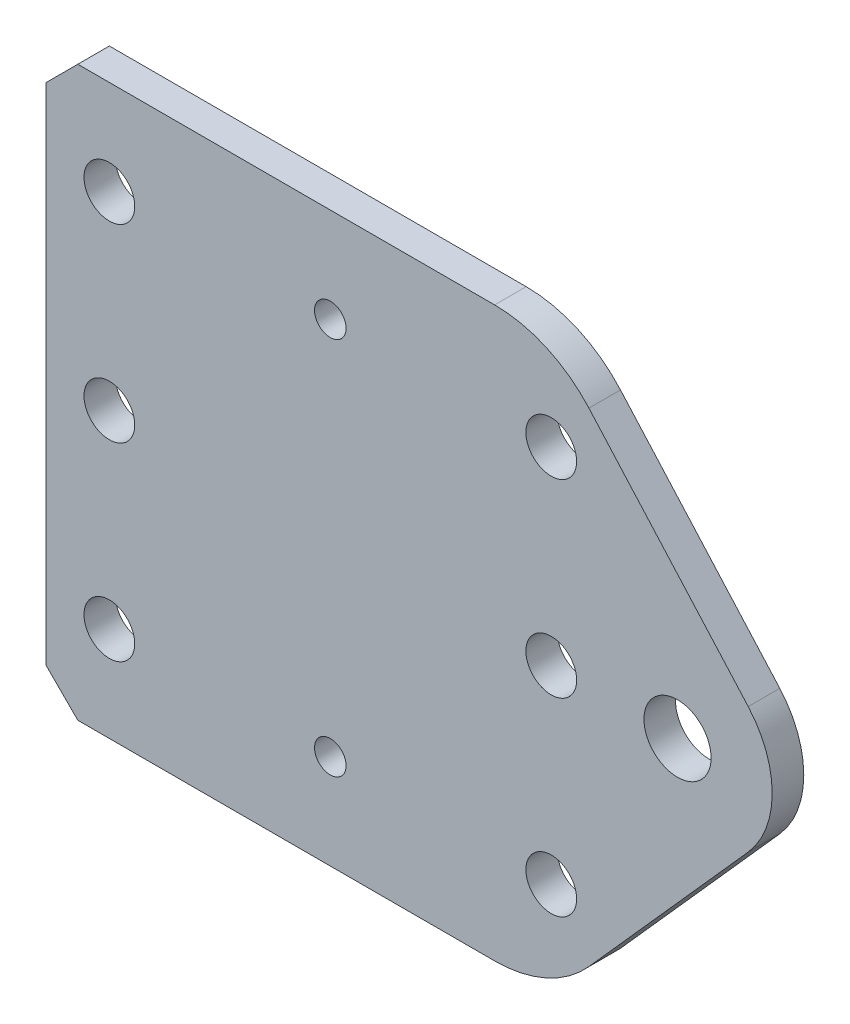
ISO-10303-21;
HEADER;
FILE_DESCRIPTION(('STEP AP214'),'2;1');
FILE_NAME('part.step','',(''),(''),'','','');
FILE_SCHEMA(('AUTOMOTIVE_DESIGN { 1 0 10303 214 1 1 1 1 }'));
ENDSEC;
DATA;
#1=APPLICATION_CONTEXT('core data for automotive mechanical design processes');
#2=APPLICATION_PROTOCOL_DEFINITION('international standard','automotive_design',2000,#1);
#3=PRODUCT_CONTEXT('',#1,'mechanical');
#4=PRODUCT('Part','Part','',(#3));
#5=PRODUCT_RELATED_PRODUCT_CATEGORY('part','',(#4));
#6=PRODUCT_DEFINITION_FORMATION('','',#4);
#7=PRODUCT_DEFINITION_CONTEXT('part definition',#1,'design');
#8=PRODUCT_DEFINITION('design','',#6,#7);
#9=PRODUCT_DEFINITION_SHAPE('','',#8);
#10=(LENGTH_UNIT() NAMED_UNIT(*) SI_UNIT(.MILLI.,.METRE.));
#11=(NAMED_UNIT(*) PLANE_ANGLE_UNIT() SI_UNIT($,.RADIAN.));
#12=(NAMED_UNIT(*) SI_UNIT($,.STERADIAN.) SOLID_ANGLE_UNIT());
#13=UNCERTAINTY_MEASURE_WITH_UNIT(LENGTH_MEASURE(1.E-05),#10,'distance_accuracy_value','');
#14=(GEOMETRIC_REPRESENTATION_CONTEXT(3) GLOBAL_UNCERTAINTY_ASSIGNED_CONTEXT((#13)) GLOBAL_UNIT_ASSIGNED_CONTEXT((#10,
#11,#12)) REPRESENTATION_CONTEXT('',''));
#15=CARTESIAN_POINT('',(0.,0.,0.));
#16=DIRECTION('',(0.,0.,1.));
#17=DIRECTION('',(1.,0.,0.));
#18=AXIS2_PLACEMENT_3D('',#15,#16,#17);
#19=CARTESIAN_POINT('',(45.1052866417071,12.7,3.175));
#20=DIRECTION('',(0.,0.,1.));
#21=DIRECTION('',(1.,0.,0.));
#22=AXIS2_PLACEMENT_3D('',#19,#20,#21);
#23=PLANE('',#22);
#24=CARTESIAN_POINT('',(28.575,47.625,3.175));
#25=DIRECTION('',(0.,0.,1.));
#26=DIRECTION('',(1.,0.,0.));
#27=AXIS2_PLACEMENT_3D('',#24,#25,#26);
#28=CIRCLE('',#27,1.5875);
#29=CARTESIAN_POINT('',(30.1625,47.625,3.175));
#30=VERTEX_POINT('',#29);
#31=EDGE_CURVE('E261',#30,#30,#28,.T.);
#32=ORIENTED_EDGE('',*,*,#31,.F.);
#33=EDGE_LOOP('',(#32));
#34=FACE_BOUND('',#33,.T.);
#35=CARTESIAN_POINT('',(28.575,9.525,3.175));
#36=DIRECTION('',(0.,0.,1.));
#37=DIRECTION('',(1.,0.,0.));
#38=AXIS2_PLACEMENT_3D('',#35,#36,#37);
#39=CIRCLE('',#38,1.5875);
#40=CARTESIAN_POINT('',(30.1625,9.525,3.175));
#41=VERTEX_POINT('',#40);
#42=EDGE_CURVE('E254',#41,#41,#39,.T.);
#43=ORIENTED_EDGE('',*,*,#42,.F.);
#44=EDGE_LOOP('',(#43));
#45=FACE_BOUND('',#44,.T.);
#46=CARTESIAN_POINT('',(50.8,28.575,3.175));
#47=DIRECTION('',(0.,0.,1.));
#48=DIRECTION('',(1.,0.,0.));
#49=AXIS2_PLACEMENT_3D('',#46,#47,#48);
#50=CIRCLE('',#49,2.5527);
#51=CARTESIAN_POINT('',(53.3527,28.575,3.175));
#52=VERTEX_POINT('',#51);
#53=EDGE_CURVE('E295',#52,#52,#50,.T.);
#54=ORIENTED_EDGE('',*,*,#53,.F.);
#55=EDGE_LOOP('',(#54));
#56=FACE_BOUND('',#55,.T.);
#57=CARTESIAN_POINT('',(6.35,28.575,3.175));
#58=DIRECTION('',(0.,0.,1.));
#59=DIRECTION('',(1.,0.,0.));
#60=AXIS2_PLACEMENT_3D('',#57,#58,#59);
#61=CIRCLE('',#60,2.5527);
#62=CARTESIAN_POINT('',(8.9027,28.575,3.175));
#63=VERTEX_POINT('',#62);
#64=EDGE_CURVE('E271',#63,#63,#61,.T.);
#65=ORIENTED_EDGE('',*,*,#64,.F.);
#66=EDGE_LOOP('',(#65));
#67=FACE_BOUND('',#66,.T.);
#68=CARTESIAN_POINT('',(6.35,47.625,3.175));
#69=DIRECTION('',(0.,0.,1.));
#70=DIRECTION('',(1.,0.,0.));
#71=AXIS2_PLACEMENT_3D('',#68,#69,#70);
#72=CIRCLE('',#71,2.5527);
#73=CARTESIAN_POINT('',(8.9027,47.625,3.175));
#74=VERTEX_POINT('',#73);
#75=EDGE_CURVE('E279',#74,#74,#72,.T.);
#76=ORIENTED_EDGE('',*,*,#75,.F.);
#77=EDGE_LOOP('',(#76));
#78=FACE_BOUND('',#77,.T.);
#79=CARTESIAN_POINT('',(50.8,47.625,3.175));
#80=DIRECTION('',(0.,0.,1.));
#81=DIRECTION('',(1.,0.,0.));
#82=AXIS2_PLACEMENT_3D('',#79,#80,#81);
#83=CIRCLE('',#82,2.5527);
#84=CARTESIAN_POINT('',(53.3527,47.625,3.175));
#85=VERTEX_POINT('',#84);
#86=EDGE_CURVE('E288',#85,#85,#83,.T.);
#87=ORIENTED_EDGE('',*,*,#86,.F.);
#88=EDGE_LOOP('',(#87));
#89=FACE_BOUND('',#88,.T.);
#90=CARTESIAN_POINT('',(50.8,9.525,3.175));
#91=DIRECTION('',(0.,0.,1.));
#92=DIRECTION('',(1.,0.,0.));
#93=AXIS2_PLACEMENT_3D('',#90,#91,#92);
#94=CIRCLE('',#93,2.5527);
#95=CARTESIAN_POINT('',(53.3527,9.525,3.175));
#96=VERTEX_POINT('',#95);
#97=EDGE_CURVE('E263',#96,#96,#94,.T.);
#98=ORIENTED_EDGE('',*,*,#97,.F.);
#99=EDGE_LOOP('',(#98));
#100=FACE_BOUND('',#99,.T.);
#101=CARTESIAN_POINT('',(6.35,9.525,3.175));
#102=DIRECTION('',(0.,0.,1.));
#103=DIRECTION('',(1.,0.,0.));
#104=AXIS2_PLACEMENT_3D('',#101,#102,#103);
#105=CIRCLE('',#104,2.5527);
#106=CARTESIAN_POINT('',(8.9027,9.525,3.175));
#107=VERTEX_POINT('',#106);
#108=EDGE_CURVE('E248',#107,#107,#105,.T.);
#109=ORIENTED_EDGE('',*,*,#108,.F.);
#110=EDGE_LOOP('',(#109));
#111=FACE_BOUND('',#110,.T.);
#112=DIRECTION('',(0.,-1.,0.));
#113=VECTOR('',#112,1.);
#114=CARTESIAN_POINT('',(0.,57.15,3.175));
#115=LINE('',#114,#113);
#116=CARTESIAN_POINT('',(0.,53.975,3.175));
#117=VERTEX_POINT('',#116);
#118=CARTESIAN_POINT('',(0.,3.17500000000001,3.175));
#119=VERTEX_POINT('',#118);
#120=EDGE_CURVE('E151',#117,#119,#115,.T.);
#121=ORIENTED_EDGE('',*,*,#120,.T.);
#122=DIRECTION('',(-0.707106781186546,0.707106781186549,0.));
#123=VECTOR('',#122,1.);
#124=CARTESIAN_POINT('',(17.7901433208534,-14.6151433208535,3.175));
#125=LINE('',#124,#123);
#126=CARTESIAN_POINT('',(3.175,0.,3.175));
#127=VERTEX_POINT('',#126);
#128=EDGE_CURVE('E53',#119,#127,#125,.F.);
#129=ORIENTED_EDGE('',*,*,#128,.T.);
#130=DIRECTION('',(1.,0.,0.));
#131=VECTOR('',#130,1.);
#132=CARTESIAN_POINT('',(0.,0.,3.175));
#133=LINE('',#132,#131);
#134=CARTESIAN_POINT('',(45.1052866417071,0.,3.175));
#135=VERTEX_POINT('',#134);
#136=EDGE_CURVE('E140',#127,#135,#133,.T.);
#137=ORIENTED_EDGE('',*,*,#136,.T.);
#138=CARTESIAN_POINT('',(45.1052866417071,12.7,3.175));
#139=DIRECTION('',(0.,0.,1.));
#140=DIRECTION('',(1.,0.,0.));
#141=AXIS2_PLACEMENT_3D('',#138,#139,#140);
#142=CIRCLE('',#141,12.7);
#143=CARTESIAN_POINT('',(54.5880602777446,4.25210060620556,3.175));
#144=VERTEX_POINT('',#143);
#145=EDGE_CURVE('E144',#135,#144,#142,.T.);
#146=ORIENTED_EDGE('',*,*,#145,.T.);
#147=DIRECTION('',(0.665188928645231,0.746675089451771,0.));
#148=VECTOR('',#147,1.);
#149=CARTESIAN_POINT('',(54.5880602777446,4.25210060620556,3.175));
#150=LINE('',#149,#148);
#151=CARTESIAN_POINT('',(70.6120802270281,22.2390754546542,3.175));
#152=VERTEX_POINT('',#151);
#153=EDGE_CURVE('E168',#144,#152,#150,.T.);
#154=ORIENTED_EDGE('',*,*,#153,.T.);
#155=CARTESIAN_POINT('',(63.5,28.575,3.175));
#156=DIRECTION('',(0.,0.,1.));
#157=DIRECTION('',(1.,0.,0.));
#158=AXIS2_PLACEMENT_3D('',#155,#156,#157);
#159=CIRCLE('',#158,9.525);
#160=CARTESIAN_POINT('',(70.6120802270281,34.9109245453458,3.175));
#161=VERTEX_POINT('',#160);
#162=EDGE_CURVE('E172',#152,#161,#159,.T.);
#163=ORIENTED_EDGE('',*,*,#162,.T.);
#164=DIRECTION('',(-0.665188928645231,0.746675089451771,0.));
#165=VECTOR('',#164,1.);
#166=CARTESIAN_POINT('',(70.6120802270281,34.9109245453458,3.175));
#167=LINE('',#166,#165);
#168=CARTESIAN_POINT('',(54.5880602777446,52.8978993937944,3.175));
#169=VERTEX_POINT('',#168);
#170=EDGE_CURVE('E178',#161,#169,#167,.T.);
#171=ORIENTED_EDGE('',*,*,#170,.T.);
#172=CARTESIAN_POINT('',(45.1052866417071,44.45,3.175));
#173=DIRECTION('',(0.,0.,1.));
#174=DIRECTION('',(1.,0.,0.));
#175=AXIS2_PLACEMENT_3D('',#172,#173,#174);
#176=CIRCLE('',#175,12.7);
#177=CARTESIAN_POINT('',(45.1052866417071,57.15,3.175));
#178=VERTEX_POINT('',#177);
#179=EDGE_CURVE('E181',#169,#178,#176,.T.);
#180=ORIENTED_EDGE('',*,*,#179,.T.);
#181=DIRECTION('',(-1.,0.,0.));
#182=VECTOR('',#181,1.);
#183=CARTESIAN_POINT('',(45.1052866417071,57.15,3.175));
#184=LINE('',#183,#182);
#185=CARTESIAN_POINT('',(3.17500000000001,57.15,3.175));
#186=VERTEX_POINT('',#185);
#187=EDGE_CURVE('E184',#178,#186,#184,.T.);
#188=ORIENTED_EDGE('',*,*,#187,.T.);
#189=DIRECTION('',(0.707106781186549,0.707106781186546,0.));
#190=VECTOR('',#189,1.);
#191=CARTESIAN_POINT('',(1.91514332085364,55.8901433208536,3.175));
#192=LINE('',#191,#190);
#193=EDGE_CURVE('E240',#186,#117,#192,.F.);
#194=ORIENTED_EDGE('',*,*,#193,.T.);
#195=EDGE_LOOP('',(#121,#129,#137,#146,#154,#163,#171,#180,#188,#194));
#196=FACE_BOUND('',#195,.T.);
#197=CARTESIAN_POINT('',(63.5,28.575,3.175));
#198=DIRECTION('',(0.,0.,1.));
#199=DIRECTION('',(1.,0.,0.));
#200=AXIS2_PLACEMENT_3D('',#197,#198,#199);
#201=CIRCLE('',#200,3.37819999999999);
#202=CARTESIAN_POINT('',(66.8782,28.575,3.175));
#203=VERTEX_POINT('',#202);
#204=EDGE_CURVE('E191',#203,#203,#201,.T.);
#205=ORIENTED_EDGE('',*,*,#204,.F.);
#206=EDGE_LOOP('',(#205));
#207=FACE_BOUND('',#206,.T.);
#208=ADVANCED_FACE('F43',(#34,#45,#56,#67,#78,#89,#100,#111,#196,#207),#23,.T.);
#209=CARTESIAN_POINT('',(45.1052866417071,12.7,0.));
#210=DIRECTION('',(0.,0.,1.));
#211=DIRECTION('',(1.,0.,0.));
#212=AXIS2_PLACEMENT_3D('',#209,#210,#211);
#213=PLANE('',#212);
#214=CARTESIAN_POINT('',(28.575,47.625,0.));
#215=DIRECTION('',(0.,0.,1.));
#216=DIRECTION('',(1.,0.,0.));
#217=AXIS2_PLACEMENT_3D('',#214,#215,#216);
#218=CIRCLE('',#217,1.5875);
#219=CARTESIAN_POINT('',(30.1625,47.625,0.));
#220=VERTEX_POINT('',#219);
#221=EDGE_CURVE('E291',#220,#220,#218,.T.);
#222=ORIENTED_EDGE('',*,*,#221,.T.);
#223=EDGE_LOOP('',(#222));
#224=FACE_BOUND('',#223,.T.);
#225=CARTESIAN_POINT('',(28.575,9.525,0.));
#226=DIRECTION('',(0.,0.,1.));
#227=DIRECTION('',(1.,0.,0.));
#228=AXIS2_PLACEMENT_3D('',#225,#226,#227);
#229=CIRCLE('',#228,1.5875);
#230=CARTESIAN_POINT('',(30.1625,9.525,0.));
#231=VERTEX_POINT('',#230);
#232=EDGE_CURVE('E257',#231,#231,#229,.T.);
#233=ORIENTED_EDGE('',*,*,#232,.T.);
#234=EDGE_LOOP('',(#233));
#235=FACE_BOUND('',#234,.T.);
#236=CARTESIAN_POINT('',(50.8,28.575,0.));
#237=DIRECTION('',(0.,0.,1.));
#238=DIRECTION('',(1.,0.,0.));
#239=AXIS2_PLACEMENT_3D('',#236,#237,#238);
#240=CIRCLE('',#239,2.5527);
#241=CARTESIAN_POINT('',(53.3527,28.575,0.));
#242=VERTEX_POINT('',#241);
#243=EDGE_CURVE('E275',#242,#242,#240,.T.);
#244=ORIENTED_EDGE('',*,*,#243,.T.);
#245=EDGE_LOOP('',(#244));
#246=FACE_BOUND('',#245,.T.);
#247=CARTESIAN_POINT('',(6.35,28.575,0.));
#248=DIRECTION('',(0.,0.,1.));
#249=DIRECTION('',(1.,0.,0.));
#250=AXIS2_PLACEMENT_3D('',#247,#248,#249);
#251=CIRCLE('',#250,2.5527);
#252=CARTESIAN_POINT('',(8.9027,28.575,0.));
#253=VERTEX_POINT('',#252);
#254=EDGE_CURVE('E274',#253,#253,#251,.T.);
#255=ORIENTED_EDGE('',*,*,#254,.T.);
#256=EDGE_LOOP('',(#255));
#257=FACE_BOUND('',#256,.T.);
#258=CARTESIAN_POINT('',(6.35,47.625,0.));
#259=DIRECTION('',(0.,0.,1.));
#260=DIRECTION('',(1.,0.,0.));
#261=AXIS2_PLACEMENT_3D('',#258,#259,#260);
#262=CIRCLE('',#261,2.5527);
#263=CARTESIAN_POINT('',(8.9027,47.625,0.));
#264=VERTEX_POINT('',#263);
#265=EDGE_CURVE('E283',#264,#264,#262,.T.);
#266=ORIENTED_EDGE('',*,*,#265,.T.);
#267=EDGE_LOOP('',(#266));
#268=FACE_BOUND('',#267,.T.);
#269=CARTESIAN_POINT('',(50.8,47.625,0.));
#270=DIRECTION('',(0.,0.,1.));
#271=DIRECTION('',(1.,0.,0.));
#272=AXIS2_PLACEMENT_3D('',#269,#270,#271);
#273=CIRCLE('',#272,2.5527);
#274=CARTESIAN_POINT('',(53.3527,47.625,0.));
#275=VERTEX_POINT('',#274);
#276=EDGE_CURVE('E266',#275,#275,#273,.T.);
#277=ORIENTED_EDGE('',*,*,#276,.T.);
#278=EDGE_LOOP('',(#277));
#279=FACE_BOUND('',#278,.T.);
#280=CARTESIAN_POINT('',(50.8,9.525,0.));
#281=DIRECTION('',(0.,0.,1.));
#282=DIRECTION('',(1.,0.,0.));
#283=AXIS2_PLACEMENT_3D('',#280,#281,#282);
#284=CIRCLE('',#283,2.5527);
#285=CARTESIAN_POINT('',(53.3527,9.525,0.));
#286=VERTEX_POINT('',#285);
#287=EDGE_CURVE('E252',#286,#286,#284,.T.);
#288=ORIENTED_EDGE('',*,*,#287,.T.);
#289=EDGE_LOOP('',(#288));
#290=FACE_BOUND('',#289,.T.);
#291=CARTESIAN_POINT('',(6.35,9.525,0.));
#292=DIRECTION('',(0.,0.,1.));
#293=DIRECTION('',(1.,0.,0.));
#294=AXIS2_PLACEMENT_3D('',#291,#292,#293);
#295=CIRCLE('',#294,2.5527);
#296=CARTESIAN_POINT('',(8.9027,9.525,0.));
#297=VERTEX_POINT('',#296);
#298=EDGE_CURVE('E244',#297,#297,#295,.T.);
#299=ORIENTED_EDGE('',*,*,#298,.T.);
#300=EDGE_LOOP('',(#299));
#301=FACE_BOUND('',#300,.T.);
#302=DIRECTION('',(1.,0.,0.));
#303=VECTOR('',#302,1.);
#304=CARTESIAN_POINT('',(0.,0.,0.));
#305=LINE('',#304,#303);
#306=CARTESIAN_POINT('',(3.175,0.,0.));
#307=VERTEX_POINT('',#306);
#308=CARTESIAN_POINT('',(45.1052866417071,0.,0.));
#309=VERTEX_POINT('',#308);
#310=EDGE_CURVE('E157',#307,#309,#305,.T.);
#311=ORIENTED_EDGE('',*,*,#310,.F.);
#312=DIRECTION('',(0.707106781186546,-0.707106781186549,0.));
#313=VECTOR('',#312,1.);
#314=CARTESIAN_POINT('',(3.175,0.,0.));
#315=LINE('',#314,#313);
#316=CARTESIAN_POINT('',(0.,3.17500000000001,0.));
#317=VERTEX_POINT('',#316);
#318=EDGE_CURVE('E232',#307,#317,#315,.F.);
#319=ORIENTED_EDGE('',*,*,#318,.T.);
#320=DIRECTION('',(0.,-1.,0.));
#321=VECTOR('',#320,1.);
#322=CARTESIAN_POINT('',(0.,57.15,0.));
#323=LINE('',#322,#321);
#324=CARTESIAN_POINT('',(0.,53.975,0.));
#325=VERTEX_POINT('',#324);
#326=EDGE_CURVE('E188',#325,#317,#323,.T.);
#327=ORIENTED_EDGE('',*,*,#326,.F.);
#328=DIRECTION('',(-0.707106781186549,-0.707106781186546,0.));
#329=VECTOR('',#328,1.);
#330=CARTESIAN_POINT('',(0.,53.975,0.));
#331=LINE('',#330,#329);
#332=CARTESIAN_POINT('',(3.17500000000001,57.15,0.));
#333=VERTEX_POINT('',#332);
#334=EDGE_CURVE('E229',#325,#333,#331,.F.);
#335=ORIENTED_EDGE('',*,*,#334,.T.);
#336=DIRECTION('',(-1.,0.,0.));
#337=VECTOR('',#336,1.);
#338=CARTESIAN_POINT('',(45.1052866417071,57.15,0.));
#339=LINE('',#338,#337);
#340=CARTESIAN_POINT('',(45.1052866417071,57.15,0.));
#341=VERTEX_POINT('',#340);
#342=EDGE_CURVE('E208',#341,#333,#339,.T.);
#343=ORIENTED_EDGE('',*,*,#342,.F.);
#344=CARTESIAN_POINT('',(45.1052866417071,44.45,0.));
#345=DIRECTION('',(0.,0.,1.));
#346=DIRECTION('',(1.,0.,0.));
#347=AXIS2_PLACEMENT_3D('',#344,#345,#346);
#348=CIRCLE('',#347,12.7);
#349=CARTESIAN_POINT('',(54.5880602777446,52.8978993937944,0.));
#350=VERTEX_POINT('',#349);
#351=EDGE_CURVE('E205',#350,#341,#348,.T.);
#352=ORIENTED_EDGE('',*,*,#351,.F.);
#353=DIRECTION('',(-0.665188928645231,0.746675089451771,0.));
#354=VECTOR('',#353,1.);
#355=CARTESIAN_POINT('',(70.6120802270281,34.9109245453458,0.));
#356=LINE('',#355,#354);
#357=CARTESIAN_POINT('',(70.6120802270281,34.9109245453458,0.));
#358=VERTEX_POINT('',#357);
#359=EDGE_CURVE('E202',#358,#350,#356,.T.);
#360=ORIENTED_EDGE('',*,*,#359,.F.);
#361=CARTESIAN_POINT('',(63.5,28.575,0.));
#362=DIRECTION('',(0.,0.,1.));
#363=DIRECTION('',(1.,0.,0.));
#364=AXIS2_PLACEMENT_3D('',#361,#362,#363);
#365=CIRCLE('',#364,9.525);
#366=CARTESIAN_POINT('',(70.6120802270281,22.2390754546542,0.));
#367=VERTEX_POINT('',#366);
#368=EDGE_CURVE('E199',#367,#358,#365,.T.);
#369=ORIENTED_EDGE('',*,*,#368,.F.);
#370=DIRECTION('',(0.665188928645231,0.746675089451771,0.));
#371=VECTOR('',#370,1.);
#372=CARTESIAN_POINT('',(54.5880602777446,4.25210060620556,0.));
#373=LINE('',#372,#371);
#374=CARTESIAN_POINT('',(54.5880602777446,4.25210060620556,0.));
#375=VERTEX_POINT('',#374);
#376=EDGE_CURVE('E196',#375,#367,#373,.T.);
#377=ORIENTED_EDGE('',*,*,#376,.F.);
#378=CARTESIAN_POINT('',(45.1052866417071,12.7,0.));
#379=DIRECTION('',(0.,0.,1.));
#380=DIRECTION('',(1.,0.,0.));
#381=AXIS2_PLACEMENT_3D('',#378,#379,#380);
#382=CIRCLE('',#381,12.7);
#383=EDGE_CURVE('E194',#309,#375,#382,.T.);
#384=ORIENTED_EDGE('',*,*,#383,.F.);
#385=EDGE_LOOP('',(#311,#319,#327,#335,#343,#352,#360,#369,#377,#384));
#386=FACE_BOUND('',#385,.T.);
#387=CARTESIAN_POINT('',(63.5,28.575,0.));
#388=DIRECTION('',(0.,0.,1.));
#389=DIRECTION('',(1.,0.,0.));
#390=AXIS2_PLACEMENT_3D('',#387,#388,#389);
#391=CIRCLE('',#390,3.37819999999999);
#392=CARTESIAN_POINT('',(66.8782,28.575,0.));
#393=VERTEX_POINT('',#392);
#394=EDGE_CURVE('E247',#393,#393,#391,.T.);
#395=ORIENTED_EDGE('',*,*,#394,.T.);
#396=EDGE_LOOP('',(#395));
#397=FACE_BOUND('',#396,.T.);
#398=ADVANCED_FACE('F317',(#224,#235,#246,#257,#268,#279,#290,#301,#386,#397),#213,.F.);
#399=CARTESIAN_POINT('',(0.,57.15,3.175));
#400=DIRECTION('',(1.,0.,0.));
#401=DIRECTION('',(0.,0.,-1.));
#402=AXIS2_PLACEMENT_3D('',#399,#400,#401);
#403=PLANE('',#402);
#404=ORIENTED_EDGE('',*,*,#326,.T.);
#405=DIRECTION('',(0.,0.,1.));
#406=VECTOR('',#405,1.);
#407=CARTESIAN_POINT('',(0.,3.17500000000001,3.175));
#408=LINE('',#407,#406);
#409=EDGE_CURVE('E72',#317,#119,#408,.T.);
#410=ORIENTED_EDGE('',*,*,#409,.T.);
#411=ORIENTED_EDGE('',*,*,#120,.F.);
#412=DIRECTION('',(0.,0.,-1.));
#413=VECTOR('',#412,1.);
#414=CARTESIAN_POINT('',(0.,53.975,3.175));
#415=LINE('',#414,#413);
#416=EDGE_CURVE('E234',#117,#325,#415,.T.);
#417=ORIENTED_EDGE('',*,*,#416,.T.);
#418=EDGE_LOOP('',(#404,#410,#411,#417));
#419=FACE_BOUND('',#418,.T.);
#420=ADVANCED_FACE('F340',(#419),#403,.F.);
#421=CARTESIAN_POINT('',(0.,0.,3.175));
#422=DIRECTION('',(0.,1.,0.));
#423=DIRECTION('',(0.,0.,1.));
#424=AXIS2_PLACEMENT_3D('',#421,#422,#423);
#425=PLANE('',#424);
#426=ORIENTED_EDGE('',*,*,#136,.F.);
#427=DIRECTION('',(0.,0.,-1.));
#428=VECTOR('',#427,1.);
#429=CARTESIAN_POINT('',(3.175,0.,3.175));
#430=LINE('',#429,#428);
#431=EDGE_CURVE('E161',#127,#307,#430,.T.);
#432=ORIENTED_EDGE('',*,*,#431,.T.);
#433=ORIENTED_EDGE('',*,*,#310,.T.);
#434=DIRECTION('',(0.,0.,-1.));
#435=VECTOR('',#434,1.);
#436=CARTESIAN_POINT('',(45.1052866417071,0.,3.175));
#437=LINE('',#436,#435);
#438=EDGE_CURVE('E154',#135,#309,#437,.T.);
#439=ORIENTED_EDGE('',*,*,#438,.F.);
#440=EDGE_LOOP('',(#426,#432,#433,#439));
#441=FACE_BOUND('',#440,.T.);
#442=ADVANCED_FACE('F155',(#441),#425,.F.);
#443=CARTESIAN_POINT('',(45.1052866417071,12.7,3.175));
#444=DIRECTION('',(0.,0.,-1.));
#445=DIRECTION('',(-1.,0.,0.));
#446=AXIS2_PLACEMENT_3D('',#443,#444,#445);
#447=CYLINDRICAL_SURFACE('',#446,12.7);
#448=ORIENTED_EDGE('',*,*,#383,.T.);
#449=DIRECTION('',(0.,0.,-1.));
#450=VECTOR('',#449,1.);
#451=CARTESIAN_POINT('',(54.5880602777446,4.25210060620556,3.175));
#452=LINE('',#451,#450);
#453=EDGE_CURVE('E162',#144,#375,#452,.T.);
#454=ORIENTED_EDGE('',*,*,#453,.F.);
#455=ORIENTED_EDGE('',*,*,#145,.F.);
#456=ORIENTED_EDGE('',*,*,#438,.T.);
#457=EDGE_LOOP('',(#448,#454,#455,#456));
#458=FACE_BOUND('',#457,.T.);
#459=ADVANCED_FACE('F164',(#458),#447,.T.);
#460=CARTESIAN_POINT('',(54.5880602777446,4.25210060620556,3.175));
#461=DIRECTION('',(-0.746675089451771,0.665188928645231,0.));
#462=DIRECTION('',(-0.665188928645231,-0.746675089451771,0.));
#463=AXIS2_PLACEMENT_3D('',#460,#461,#462);
#464=PLANE('',#463);
#465=ORIENTED_EDGE('',*,*,#376,.T.);
#466=DIRECTION('',(0.,0.,-1.));
#467=VECTOR('',#466,1.);
#468=CARTESIAN_POINT('',(70.6120802270281,22.2390754546542,3.175));
#469=LINE('',#468,#467);
#470=EDGE_CURVE('E222',#152,#367,#469,.T.);
#471=ORIENTED_EDGE('',*,*,#470,.F.);
#472=ORIENTED_EDGE('',*,*,#153,.F.);
#473=ORIENTED_EDGE('',*,*,#453,.T.);
#474=EDGE_LOOP('',(#465,#471,#472,#473));
#475=FACE_BOUND('',#474,.T.);
#476=ADVANCED_FACE('F356',(#475),#464,.F.);
#477=CARTESIAN_POINT('',(63.5,28.575,3.175));
#478=DIRECTION('',(0.,0.,-1.));
#479=DIRECTION('',(-1.,0.,0.));
#480=AXIS2_PLACEMENT_3D('',#477,#478,#479);
#481=CYLINDRICAL_SURFACE('',#480,9.525);
#482=ORIENTED_EDGE('',*,*,#368,.T.);
#483=DIRECTION('',(0.,0.,-1.));
#484=VECTOR('',#483,1.);
#485=CARTESIAN_POINT('',(70.6120802270281,34.9109245453458,3.175));
#486=LINE('',#485,#484);
#487=EDGE_CURVE('E218',#161,#358,#486,.T.);
#488=ORIENTED_EDGE('',*,*,#487,.F.);
#489=ORIENTED_EDGE('',*,*,#162,.F.);
#490=ORIENTED_EDGE('',*,*,#470,.T.);
#491=EDGE_LOOP('',(#482,#488,#489,#490));
#492=FACE_BOUND('',#491,.T.);
#493=ADVANCED_FACE('F352',(#492),#481,.T.);
#494=CARTESIAN_POINT('',(70.6120802270281,34.9109245453458,3.175));
#495=DIRECTION('',(-0.746675089451771,-0.665188928645231,0.));
#496=DIRECTION('',(0.665188928645231,-0.746675089451771,0.));
#497=AXIS2_PLACEMENT_3D('',#494,#495,#496);
#498=PLANE('',#497);
#499=ORIENTED_EDGE('',*,*,#359,.T.);
#500=DIRECTION('',(0.,0.,-1.));
#501=VECTOR('',#500,1.);
#502=CARTESIAN_POINT('',(54.5880602777446,52.8978993937944,3.175));
#503=LINE('',#502,#501);
#504=EDGE_CURVE('E214',#169,#350,#503,.T.);
#505=ORIENTED_EDGE('',*,*,#504,.F.);
#506=ORIENTED_EDGE('',*,*,#170,.F.);
#507=ORIENTED_EDGE('',*,*,#487,.T.);
#508=EDGE_LOOP('',(#499,#505,#506,#507));
#509=FACE_BOUND('',#508,.T.);
#510=ADVANCED_FACE('F348',(#509),#498,.F.);
#511=CARTESIAN_POINT('',(45.1052866417071,44.45,3.175));
#512=DIRECTION('',(0.,0.,-1.));
#513=DIRECTION('',(-1.,0.,0.));
#514=AXIS2_PLACEMENT_3D('',#511,#512,#513);
#515=CYLINDRICAL_SURFACE('',#514,12.7);
#516=ORIENTED_EDGE('',*,*,#351,.T.);
#517=DIRECTION('',(0.,0.,-1.));
#518=VECTOR('',#517,1.);
#519=CARTESIAN_POINT('',(45.1052866417071,57.15,3.175));
#520=LINE('',#519,#518);
#521=EDGE_CURVE('E187',#178,#341,#520,.T.);
#522=ORIENTED_EDGE('',*,*,#521,.F.);
#523=ORIENTED_EDGE('',*,*,#179,.F.);
#524=ORIENTED_EDGE('',*,*,#504,.T.);
#525=EDGE_LOOP('',(#516,#522,#523,#524));
#526=FACE_BOUND('',#525,.T.);
#527=ADVANCED_FACE('F332',(#526),#515,.T.);
#528=CARTESIAN_POINT('',(45.1052866417071,57.15,3.175));
#529=DIRECTION('',(0.,-1.,0.));
#530=DIRECTION('',(0.,0.,-1.));
#531=AXIS2_PLACEMENT_3D('',#528,#529,#530);
#532=PLANE('',#531);
#533=ORIENTED_EDGE('',*,*,#342,.T.);
#534=DIRECTION('',(0.,0.,1.));
#535=VECTOR('',#534,1.);
#536=CARTESIAN_POINT('',(3.17500000000001,57.15,3.175));
#537=LINE('',#536,#535);
#538=EDGE_CURVE('E11',#333,#186,#537,.T.);
#539=ORIENTED_EDGE('',*,*,#538,.T.);
#540=ORIENTED_EDGE('',*,*,#187,.F.);
#541=ORIENTED_EDGE('',*,*,#521,.T.);
#542=EDGE_LOOP('',(#533,#539,#540,#541));
#543=FACE_BOUND('',#542,.T.);
#544=ADVANCED_FACE('F322',(#543),#532,.F.);
#545=CARTESIAN_POINT('',(63.5,28.575,3.175));
#546=DIRECTION('',(0.,0.,-1.));
#547=DIRECTION('',(-1.,0.,0.));
#548=AXIS2_PLACEMENT_3D('',#545,#546,#547);
#549=CYLINDRICAL_SURFACE('',#548,3.37819999999999);
#550=ORIENTED_EDGE('',*,*,#204,.T.);
#551=EDGE_LOOP('',(#550));
#552=FACE_BOUND('',#551,.T.);
#553=ORIENTED_EDGE('',*,*,#394,.F.);
#554=EDGE_LOOP('',(#553));
#555=FACE_BOUND('',#554,.T.);
#556=ADVANCED_FACE('F319',(#552,#555),#549,.F.);
#557=CARTESIAN_POINT('',(6.35,9.525,3.175));
#558=DIRECTION('',(0.,0.,1.));
#559=DIRECTION('',(1.,0.,0.));
#560=AXIS2_PLACEMENT_3D('',#557,#558,#559);
#561=CYLINDRICAL_SURFACE('',#560,2.5527);
#562=ORIENTED_EDGE('',*,*,#298,.F.);
#563=EDGE_LOOP('',(#562));
#564=FACE_BOUND('',#563,.T.);
#565=ORIENTED_EDGE('',*,*,#108,.T.);
#566=EDGE_LOOP('',(#565));
#567=FACE_BOUND('',#566,.T.);
#568=ADVANCED_FACE('F321',(#564,#567),#561,.F.);
#569=CARTESIAN_POINT('',(50.8,9.525,3.175));
#570=DIRECTION('',(0.,0.,1.));
#571=DIRECTION('',(1.,0.,0.));
#572=AXIS2_PLACEMENT_3D('',#569,#570,#571);
#573=CYLINDRICAL_SURFACE('',#572,2.5527);
#574=ORIENTED_EDGE('',*,*,#287,.F.);
#575=EDGE_LOOP('',(#574));
#576=FACE_BOUND('',#575,.T.);
#577=ORIENTED_EDGE('',*,*,#97,.T.);
#578=EDGE_LOOP('',(#577));
#579=FACE_BOUND('',#578,.T.);
#580=ADVANCED_FACE('F329',(#576,#579),#573,.F.);
#581=CARTESIAN_POINT('',(50.8,47.625,3.175));
#582=DIRECTION('',(0.,0.,1.));
#583=DIRECTION('',(1.,0.,0.));
#584=AXIS2_PLACEMENT_3D('',#581,#582,#583);
#585=CYLINDRICAL_SURFACE('',#584,2.5527);
#586=ORIENTED_EDGE('',*,*,#276,.F.);
#587=EDGE_LOOP('',(#586));
#588=FACE_BOUND('',#587,.T.);
#589=ORIENTED_EDGE('',*,*,#86,.T.);
#590=EDGE_LOOP('',(#589));
#591=FACE_BOUND('',#590,.T.);
#592=ADVANCED_FACE('F411',(#588,#591),#585,.F.);
#593=CARTESIAN_POINT('',(6.35,47.625,3.175));
#594=DIRECTION('',(0.,0.,1.));
#595=DIRECTION('',(1.,0.,0.));
#596=AXIS2_PLACEMENT_3D('',#593,#594,#595);
#597=CYLINDRICAL_SURFACE('',#596,2.5527);
#598=ORIENTED_EDGE('',*,*,#265,.F.);
#599=EDGE_LOOP('',(#598));
#600=FACE_BOUND('',#599,.T.);
#601=ORIENTED_EDGE('',*,*,#75,.T.);
#602=EDGE_LOOP('',(#601));
#603=FACE_BOUND('',#602,.T.);
#604=ADVANCED_FACE('F401',(#600,#603),#597,.F.);
#605=CARTESIAN_POINT('',(6.35,28.575,3.175));
#606=DIRECTION('',(0.,0.,1.));
#607=DIRECTION('',(1.,0.,0.));
#608=AXIS2_PLACEMENT_3D('',#605,#606,#607);
#609=CYLINDRICAL_SURFACE('',#608,2.5527);
#610=ORIENTED_EDGE('',*,*,#254,.F.);
#611=EDGE_LOOP('',(#610));
#612=FACE_BOUND('',#611,.T.);
#613=ORIENTED_EDGE('',*,*,#64,.T.);
#614=EDGE_LOOP('',(#613));
#615=FACE_BOUND('',#614,.T.);
#616=ADVANCED_FACE('F379',(#612,#615),#609,.F.);
#617=CARTESIAN_POINT('',(50.8,28.575,3.175));
#618=DIRECTION('',(0.,0.,1.));
#619=DIRECTION('',(1.,0.,0.));
#620=AXIS2_PLACEMENT_3D('',#617,#618,#619);
#621=CYLINDRICAL_SURFACE('',#620,2.5527);
#622=ORIENTED_EDGE('',*,*,#243,.F.);
#623=EDGE_LOOP('',(#622));
#624=FACE_BOUND('',#623,.T.);
#625=ORIENTED_EDGE('',*,*,#53,.T.);
#626=EDGE_LOOP('',(#625));
#627=FACE_BOUND('',#626,.T.);
#628=ADVANCED_FACE('F371',(#624,#627),#621,.F.);
#629=CARTESIAN_POINT('',(3.175,0.,3.175));
#630=DIRECTION('',(0.707106781186549,0.707106781186546,0.));
#631=DIRECTION('',(0.,0.,-1.));
#632=AXIS2_PLACEMENT_3D('',#629,#630,#631);
#633=PLANE('',#632);
#634=ORIENTED_EDGE('',*,*,#128,.F.);
#635=ORIENTED_EDGE('',*,*,#409,.F.);
#636=ORIENTED_EDGE('',*,*,#318,.F.);
#637=ORIENTED_EDGE('',*,*,#431,.F.);
#638=EDGE_LOOP('',(#634,#635,#636,#637));
#639=FACE_BOUND('',#638,.T.);
#640=ADVANCED_FACE('F367',(#639),#633,.F.);
#641=CARTESIAN_POINT('',(0.,53.975,3.175));
#642=DIRECTION('',(0.707106781186546,-0.707106781186549,0.));
#643=DIRECTION('',(0.,0.,-1.));
#644=AXIS2_PLACEMENT_3D('',#641,#642,#643);
#645=PLANE('',#644);
#646=ORIENTED_EDGE('',*,*,#193,.F.);
#647=ORIENTED_EDGE('',*,*,#538,.F.);
#648=ORIENTED_EDGE('',*,*,#334,.F.);
#649=ORIENTED_EDGE('',*,*,#416,.F.);
#650=EDGE_LOOP('',(#646,#647,#648,#649));
#651=FACE_BOUND('',#650,.T.);
#652=ADVANCED_FACE('F46',(#651),#645,.F.);
#653=CARTESIAN_POINT('',(28.575,9.525,0.));
#654=DIRECTION('',(0.,0.,1.));
#655=DIRECTION('',(1.,0.,0.));
#656=AXIS2_PLACEMENT_3D('',#653,#654,#655);
#657=CYLINDRICAL_SURFACE('',#656,1.5875);
#658=ORIENTED_EDGE('',*,*,#232,.F.);
#659=EDGE_LOOP('',(#658));
#660=FACE_BOUND('',#659,.T.);
#661=ORIENTED_EDGE('',*,*,#42,.T.);
#662=EDGE_LOOP('',(#661));
#663=FACE_BOUND('',#662,.T.);
#664=ADVANCED_FACE('F377',(#660,#663),#657,.F.);
#665=CARTESIAN_POINT('',(28.575,47.625,0.));
#666=DIRECTION('',(0.,0.,1.));
#667=DIRECTION('',(1.,0.,0.));
#668=AXIS2_PLACEMENT_3D('',#665,#666,#667);
#669=CYLINDRICAL_SURFACE('',#668,1.5875);
#670=ORIENTED_EDGE('',*,*,#221,.F.);
#671=EDGE_LOOP('',(#670));
#672=FACE_BOUND('',#671,.T.);
#673=ORIENTED_EDGE('',*,*,#31,.T.);
#674=EDGE_LOOP('',(#673));
#675=FACE_BOUND('',#674,.T.);
#676=ADVANCED_FACE('F499',(#672,#675),#669,.F.);
#677=CLOSED_SHELL('',(#208,#398,#420,#442,#459,#476,#493,#510,#527,#544,#556,#568,#580,#592,
#604,#616,#628,#640,#652,#664,#676));
#678=MANIFOLD_SOLID_BREP('B2',#677);
#679=ADVANCED_BREP_SHAPE_REPRESENTATION('',(#18,#678),#14);
#680=SHAPE_DEFINITION_REPRESENTATION(#9,#679);
ENDSEC;
END-ISO-10303-21;
